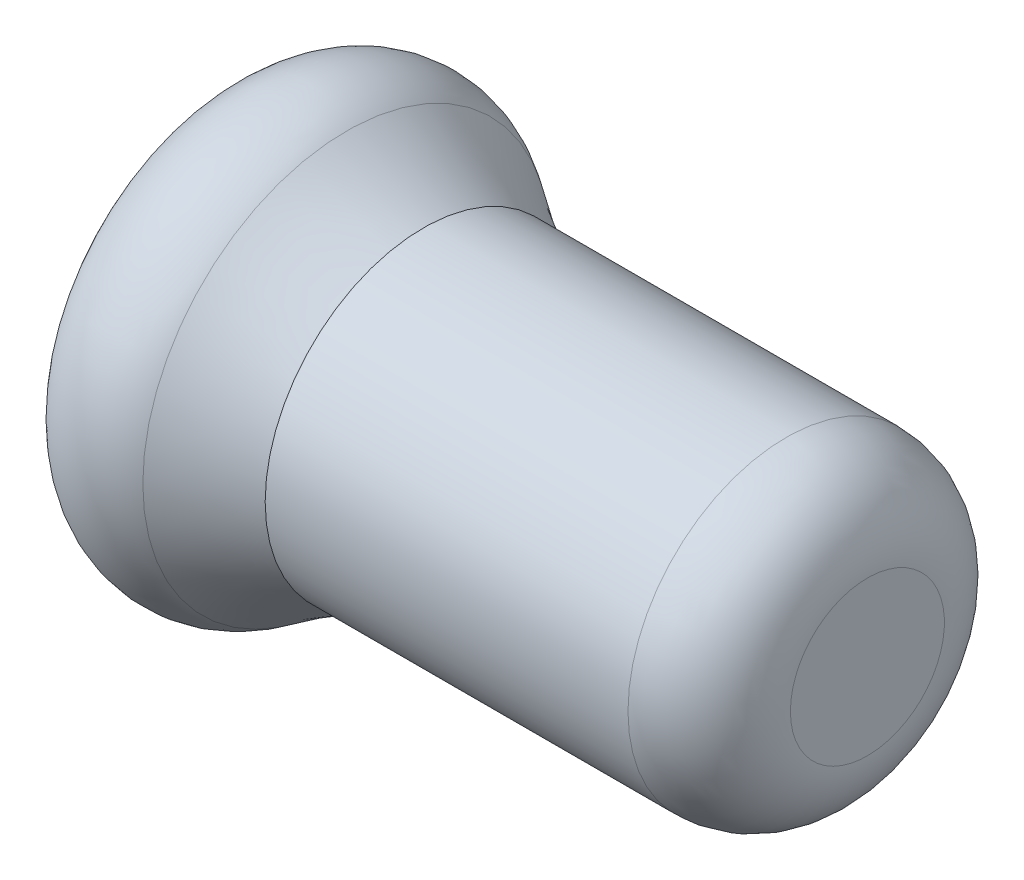
ISO-10303-21;
HEADER;
FILE_DESCRIPTION(('STEP AP214'),'2;1');
FILE_NAME('part.step','',(''),(''),'','','');
FILE_SCHEMA(('AUTOMOTIVE_DESIGN { 1 0 10303 214 1 1 1 1 }'));
ENDSEC;
DATA;
#1=APPLICATION_CONTEXT('core data for automotive mechanical design processes');
#2=APPLICATION_PROTOCOL_DEFINITION('international standard','automotive_design',2000,#1);
#3=PRODUCT_CONTEXT('',#1,'mechanical');
#4=PRODUCT('Part','Part','',(#3));
#5=PRODUCT_RELATED_PRODUCT_CATEGORY('part','',(#4));
#6=PRODUCT_DEFINITION_FORMATION('','',#4);
#7=PRODUCT_DEFINITION_CONTEXT('part definition',#1,'design');
#8=PRODUCT_DEFINITION('design','',#6,#7);
#9=PRODUCT_DEFINITION_SHAPE('','',#8);
#10=(LENGTH_UNIT() NAMED_UNIT(*) SI_UNIT(.MILLI.,.METRE.));
#11=(NAMED_UNIT(*) PLANE_ANGLE_UNIT() SI_UNIT($,.RADIAN.));
#12=(NAMED_UNIT(*) SI_UNIT($,.STERADIAN.) SOLID_ANGLE_UNIT());
#13=UNCERTAINTY_MEASURE_WITH_UNIT(LENGTH_MEASURE(1.E-05),#10,'distance_accuracy_value','');
#14=(GEOMETRIC_REPRESENTATION_CONTEXT(3) GLOBAL_UNCERTAINTY_ASSIGNED_CONTEXT((#13)) GLOBAL_UNIT_ASSIGNED_CONTEXT((#10,
#11,#12)) REPRESENTATION_CONTEXT('',''));
#15=CARTESIAN_POINT('',(0.,0.,0.));
#16=DIRECTION('',(0.,0.,1.));
#17=DIRECTION('',(1.,0.,0.));
#18=AXIS2_PLACEMENT_3D('',#15,#16,#17);
#19=CARTESIAN_POINT('',(-13.2942968783673,0.,0.));
#20=DIRECTION('',(1.,0.,0.));
#21=DIRECTION('',(0.,0.,-1.));
#22=AXIS2_PLACEMENT_3D('',#19,#20,#21);
#23=CONICAL_SURFACE('',#22,8.99995169971466,1.56694124642419);
#24=CARTESIAN_POINT('',(-13.3193548387097,0.,0.));
#25=DIRECTION('',(-1.,0.,0.));
#26=DIRECTION('',(0.,0.,1.));
#27=AXIS2_PLACEMENT_3D('',#24,#25,#26);
#28=CIRCLE('',#27,2.5);
#29=CARTESIAN_POINT('',(-13.3193548387097,0.,2.5));
#30=VERTEX_POINT('',#29);
#31=EDGE_CURVE('E64',#30,#30,#28,.T.);
#32=ORIENTED_EDGE('',*,*,#31,.F.);
#33=EDGE_LOOP('',(#32));
#34=FACE_BOUND('',#33,.T.);
#35=CARTESIAN_POINT('',(-13.2942968783673,0.,0.));
#36=DIRECTION('',(-1.,0.,0.));
#37=DIRECTION('',(0.,0.,1.));
#38=AXIS2_PLACEMENT_3D('',#35,#36,#37);
#39=CIRCLE('',#38,8.99995169971466);
#40=CARTESIAN_POINT('',(-13.2942968783673,0.,8.99995169971466));
#41=VERTEX_POINT('',#40);
#42=EDGE_CURVE('E10',#41,#41,#39,.T.);
#43=ORIENTED_EDGE('',*,*,#42,.T.);
#44=EDGE_LOOP('',(#43));
#45=FACE_BOUND('',#44,.T.);
#46=ADVANCED_FACE('F39',(#34,#45),#23,.T.);
#47=CARTESIAN_POINT('',(-8.31935483870968,0.,0.));
#48=DIRECTION('',(-1.,0.,0.));
#49=DIRECTION('',(0.,0.,1.));
#50=AXIS2_PLACEMENT_3D('',#47,#48,#49);
#51=TOROIDAL_SURFACE('',#50,8.5,5.);
#52=ORIENTED_EDGE('',*,*,#42,.F.);
#53=EDGE_LOOP('',(#52));
#54=FACE_BOUND('',#53,.T.);
#55=CARTESIAN_POINT('',(-5.38347673379737,0.,0.));
#56=DIRECTION('',(-1.,0.,0.));
#57=DIRECTION('',(0.,0.,1.));
#58=AXIS2_PLACEMENT_3D('',#55,#56,#57);
#59=CIRCLE('',#58,12.5472978335053);
#60=CARTESIAN_POINT('',(-5.38347673379737,0.,12.5472978335053));
#61=VERTEX_POINT('',#60);
#62=EDGE_CURVE('E45',#61,#61,#59,.T.);
#63=ORIENTED_EDGE('',*,*,#62,.T.);
#64=EDGE_LOOP('',(#63));
#65=FACE_BOUND('',#64,.T.);
#66=ADVANCED_FACE('F71',(#54,#65),#51,.T.);
#67=CARTESIAN_POINT('',(12.2317918956764,0.,0.));
#68=DIRECTION('',(-1.,0.,0.));
#69=DIRECTION('',(0.,0.,1.));
#70=AXIS2_PLACEMENT_3D('',#67,#68,#69);
#71=TOROIDAL_SURFACE('',#70,36.831084834537,30.);
#72=ORIENTED_EDGE('',*,*,#62,.F.);
#73=EDGE_LOOP('',(#72));
#74=FACE_BOUND('',#73,.T.);
#75=CARTESIAN_POINT('',(-0.656411636391177,0.,0.));
#76=DIRECTION('',(-1.,0.,0.));
#77=DIRECTION('',(0.,0.,1.));
#78=AXIS2_PLACEMENT_3D('',#75,#76,#77);
#79=CIRCLE('',#78,9.74060293192032);
#80=CARTESIAN_POINT('',(-0.656411636391177,0.,9.74060293192032));
#81=VERTEX_POINT('',#80);
#82=EDGE_CURVE('E49',#81,#81,#79,.T.);
#83=ORIENTED_EDGE('',*,*,#82,.T.);
#84=EDGE_LOOP('',(#83));
#85=FACE_BOUND('',#84,.T.);
#86=ADVANCED_FACE('F75',(#74,#85),#71,.F.);
#87=CARTESIAN_POINT('',(-16.0091654714961,0.,0.));
#88=DIRECTION('',(-1.,0.,0.));
#89=DIRECTION('',(0.,0.,1.));
#90=AXIS2_PLACEMENT_3D('',#87,#88,#89);
#91=CYLINDRICAL_SURFACE('',#90,9.74060293192032);
#92=ORIENTED_EDGE('',*,*,#82,.F.);
#93=EDGE_LOOP('',(#92));
#94=FACE_BOUND('',#93,.T.);
#95=CARTESIAN_POINT('',(21.6806451612903,0.,0.));
#96=DIRECTION('',(-1.,0.,0.));
#97=DIRECTION('',(0.,0.,1.));
#98=AXIS2_PLACEMENT_3D('',#95,#96,#97);
#99=CIRCLE('',#98,9.74060293192032);
#100=CARTESIAN_POINT('',(21.6806451612903,0.,9.74060293192032));
#101=VERTEX_POINT('',#100);
#102=EDGE_CURVE('E53',#101,#101,#99,.T.);
#103=ORIENTED_EDGE('',*,*,#102,.T.);
#104=EDGE_LOOP('',(#103));
#105=FACE_BOUND('',#104,.T.);
#106=ADVANCED_FACE('F80',(#94,#105),#91,.T.);
#107=CARTESIAN_POINT('',(21.6806451612903,0.,0.));
#108=DIRECTION('',(-1.,0.,0.));
#109=DIRECTION('',(0.,0.,1.));
#110=AXIS2_PLACEMENT_3D('',#107,#108,#109);
#111=DEGENERATE_TOROIDAL_SURFACE('',#110,4.74060293192032,5.,.T.);
#112=ORIENTED_EDGE('',*,*,#102,.F.);
#113=EDGE_LOOP('',(#112));
#114=FACE_BOUND('',#113,.T.);
#115=CARTESIAN_POINT('',(26.6806451612903,0.,0.));
#116=DIRECTION('',(-1.,0.,0.));
#117=DIRECTION('',(0.,0.,1.));
#118=AXIS2_PLACEMENT_3D('',#115,#116,#117);
#119=CIRCLE('',#118,4.74060293192032);
#120=CARTESIAN_POINT('',(26.6806451612903,0.,4.74060293192032));
#121=VERTEX_POINT('',#120);
#122=EDGE_CURVE('E58',#121,#121,#119,.T.);
#123=ORIENTED_EDGE('',*,*,#122,.T.);
#124=EDGE_LOOP('',(#123));
#125=FACE_BOUND('',#124,.T.);
#126=ADVANCED_FACE('F86',(#114,#125),#111,.T.);
#127=CARTESIAN_POINT('',(26.6806451612903,2.,0.));
#128=DIRECTION('',(-1.,0.,0.));
#129=DIRECTION('',(0.,0.,1.));
#130=AXIS2_PLACEMENT_3D('',#127,#128,#129);
#131=PLANE('',#130);
#132=ORIENTED_EDGE('',*,*,#122,.F.);
#133=EDGE_LOOP('',(#132));
#134=FACE_BOUND('',#133,.T.);
#135=ADVANCED_FACE('F90',(#134),#131,.F.);
#136=CARTESIAN_POINT('',(21.6806451612903,0.,0.));
#137=DIRECTION('',(1.,0.,0.));
#138=DIRECTION('',(0.,0.,-1.));
#139=AXIS2_PLACEMENT_3D('',#136,#137,#138);
#140=PLANE('',#139);
#141=CARTESIAN_POINT('',(21.6806451612903,0.,0.));
#142=DIRECTION('',(-1.,0.,0.));
#143=DIRECTION('',(0.,0.,1.));
#144=AXIS2_PLACEMENT_3D('',#141,#142,#143);
#145=CIRCLE('',#144,2.5);
#146=CARTESIAN_POINT('',(21.6806451612903,0.,2.5));
#147=VERTEX_POINT('',#146);
#148=EDGE_CURVE('E61',#147,#147,#145,.T.);
#149=ORIENTED_EDGE('',*,*,#148,.T.);
#150=EDGE_LOOP('',(#149));
#151=FACE_BOUND('',#150,.T.);
#152=ADVANCED_FACE('F94',(#151),#140,.F.);
#153=CARTESIAN_POINT('',(-16.0091654714961,0.,0.));
#154=DIRECTION('',(-1.,0.,0.));
#155=DIRECTION('',(0.,0.,1.));
#156=AXIS2_PLACEMENT_3D('',#153,#154,#155);
#157=CYLINDRICAL_SURFACE('',#156,2.5);
#158=ORIENTED_EDGE('',*,*,#148,.F.);
#159=EDGE_LOOP('',(#158));
#160=FACE_BOUND('',#159,.T.);
#161=ORIENTED_EDGE('',*,*,#31,.T.);
#162=EDGE_LOOP('',(#161));
#163=FACE_BOUND('',#162,.T.);
#164=ADVANCED_FACE('F68',(#160,#163),#157,.F.);
#165=CLOSED_SHELL('',(#46,#66,#86,#106,#126,#135,#152,#164));
#166=MANIFOLD_SOLID_BREP('B2',#165);
#167=ADVANCED_BREP_SHAPE_REPRESENTATION('',(#18,#166),#14);
#168=SHAPE_DEFINITION_REPRESENTATION(#9,#167);
ENDSEC;
END-ISO-10303-21;
